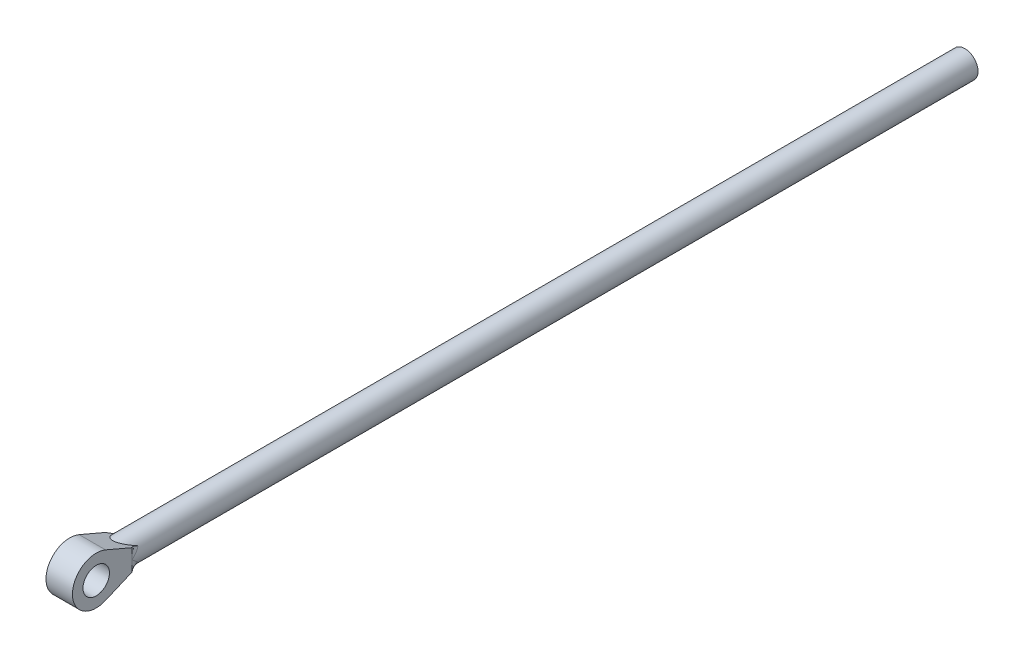
ISO-10303-21;
HEADER;
FILE_DESCRIPTION(('STEP AP214'),'2;1');
FILE_NAME('part.step','',(''),(''),'','','');
FILE_SCHEMA(('AUTOMOTIVE_DESIGN { 1 0 10303 214 1 1 1 1 }'));
ENDSEC;
DATA;
#1=APPLICATION_CONTEXT('core data for automotive mechanical design processes');
#2=APPLICATION_PROTOCOL_DEFINITION('international standard','automotive_design',2000,#1);
#3=PRODUCT_CONTEXT('',#1,'mechanical');
#4=PRODUCT('Part','Part','',(#3));
#5=PRODUCT_RELATED_PRODUCT_CATEGORY('part','',(#4));
#6=PRODUCT_DEFINITION_FORMATION('','',#4);
#7=PRODUCT_DEFINITION_CONTEXT('part definition',#1,'design');
#8=PRODUCT_DEFINITION('design','',#6,#7);
#9=PRODUCT_DEFINITION_SHAPE('','',#8);
#10=(LENGTH_UNIT() NAMED_UNIT(*) SI_UNIT(.MILLI.,.METRE.));
#11=(NAMED_UNIT(*) PLANE_ANGLE_UNIT() SI_UNIT($,.RADIAN.));
#12=(NAMED_UNIT(*) SI_UNIT($,.STERADIAN.) SOLID_ANGLE_UNIT());
#13=UNCERTAINTY_MEASURE_WITH_UNIT(LENGTH_MEASURE(1.E-05),#10,'distance_accuracy_value','');
#14=(GEOMETRIC_REPRESENTATION_CONTEXT(3) GLOBAL_UNCERTAINTY_ASSIGNED_CONTEXT((#13)) GLOBAL_UNIT_ASSIGNED_CONTEXT((#10,
#11,#12)) REPRESENTATION_CONTEXT('',''));
#15=CARTESIAN_POINT('',(0.,0.,0.));
#16=DIRECTION('',(0.,0.,1.));
#17=DIRECTION('',(1.,0.,0.));
#18=AXIS2_PLACEMENT_3D('',#15,#16,#17);
#19=CARTESIAN_POINT('',(3.175,-2.54,-8.59666640241181));
#20=DIRECTION('',(0.,0.919488252420341,0.393117480736976));
#21=DIRECTION('',(0.,-0.393117480736976,0.919488252420342));
#22=AXIS2_PLACEMENT_3D('',#19,#20,#21);
#23=PLANE('',#22);
#24=CARTESIAN_POINT('',(0.,0.,-14.5376389502871));
#25=DIRECTION('',(0.,0.919488252420341,0.393117480736976));
#26=DIRECTION('',(0.,0.393117480736976,-0.919488252420342));
#27=AXIS2_PLACEMENT_3D('',#24,#25,#26);
#28=ELLIPSE('',#27,8.07646608349199,3.175);
#29=CARTESIAN_POINT('',(2.67478021597462,-1.71060685028173,-10.5365884236224));
#30=VERTEX_POINT('',#29);
#31=CARTESIAN_POINT('',(-2.67478021597462,-1.71060685028173,-10.5365884236224));
#32=VERTEX_POINT('',#31);
#33=EDGE_CURVE('E59',#30,#32,#28,.F.);
#34=ORIENTED_EDGE('',*,*,#33,.F.);
#35=CARTESIAN_POINT('',(3.175,-3.99391372425977,-8.59666640241181));
#36=CARTESIAN_POINT('',(1.91635195902802,-2.58180728087389,-9.08135002022511));
#37=CARTESIAN_POINT('',(2.2709843247912,-2.2188409579221,-10.9669928924115));
#38=CARTESIAN_POINT('',(3.175,-3.89822005365016,-8.59666640241181));
#39=CARTESIAN_POINT('',(1.95759279660153,-2.55659693582673,-9.12196996566286));
#40=CARTESIAN_POINT('',(2.32292862845712,-2.16567780741768,-10.930950971675));
#41=CARTESIAN_POINT('',(3.175,-3.80022115930709,-8.59666640241181));
#42=CARTESIAN_POINT('',(2.00429072887889,-2.5244105662156,-9.15651333968208));
#43=CARTESIAN_POINT('',(2.37247234749937,-2.1112339772152,-10.8902967558312));
#44=CARTESIAN_POINT('',(3.175,-3.60055329402831,-8.59666640241181));
#45=CARTESIAN_POINT('',(2.10288828272783,-2.44821078011972,-9.2124927740083));
#46=CARTESIAN_POINT('',(2.46671432485945,-2.0003073854646,-10.8012878913684));
#47=CARTESIAN_POINT('',(3.175,-3.49889095821979,-8.59666640241181));
#48=CARTESIAN_POINT('',(2.15470476601244,-2.40445660023307,-9.23428275530779));
#49=CARTESIAN_POINT('',(2.51142080890993,-1.9438283100981,-10.7529466716865));
#50=CARTESIAN_POINT('',(3.175,-3.29305802574432,-8.59666640241181));
#51=CARTESIAN_POINT('',(2.25918856417076,-2.30694472080806,-9.26551549867763));
#52=CARTESIAN_POINT('',(2.59589449034021,-1.82947668099294,-10.6502315770057));
#53=CARTESIAN_POINT('',(3.175,-3.18890394684718,-8.59666640241181));
#54=CARTESIAN_POINT('',(2.31189565918958,-2.25339342902035,-9.27530338538349));
#55=CARTESIAN_POINT('',(2.63568706696168,-1.77161330379369,-10.5958917037651));
#56=CARTESIAN_POINT('',(3.175,-2.97809879860918,-8.59666640241181));
#57=CARTESIAN_POINT('',(2.415737066997,-2.13788631172421,-9.28426183538017));
#58=CARTESIAN_POINT('',(2.71073717770064,-1.65449933253319,-10.4820493293361));
#59=CARTESIAN_POINT('',(3.175,-2.87144627945739,-8.59666640241181));
#60=CARTESIAN_POINT('',(2.46698878164801,-2.07598791576069,-9.2836366142665));
#61=CARTESIAN_POINT('',(2.74599199749794,-1.59524793302146,-10.4225437735276));
#62=CARTESIAN_POINT('',(3.175,-2.45809990923821,-8.59666640241181));
#63=CARTESIAN_POINT('',(2.65372910886165,-1.82885051358634,-9.26383542983603));
#64=CARTESIAN_POINT('',(2.87287229613947,-1.36561106071748,-10.1860471642477));
#65=CARTESIAN_POINT('',(3.175,-2.14412743110158,-8.59666640241181));
#66=CARTESIAN_POINT('',(2.78145144382993,-1.61490717806444,-9.2138654185811));
#67=CARTESIAN_POINT('',(2.9489698685196,-1.19118190617343,-9.99419431779141));
#68=CARTESIAN_POINT('',(3.175,-1.50745726875889,-8.59666640241181));
#69=CARTESIAN_POINT('',(2.98354146972774,-1.159687990128,-9.07123962113244));
#70=CARTESIAN_POINT('',(3.06825926307117,-0.837476260415707,-9.59223853373834));
#71=CARTESIAN_POINT('',(3.175,-1.18474093473537,-8.59666640241181));
#72=CARTESIAN_POINT('',(3.06100044766743,-0.91555636745583,-8.97863920011173));
#73=CARTESIAN_POINT('',(3.11137388897597,-0.658189408192424,-9.38209405614999));
#74=CARTESIAN_POINT('',(3.175,-0.71952408724998,-8.59666640241181));
#75=CARTESIAN_POINT('',(3.13141138232832,-0.558155895048426,-8.83342360639511));
#76=CARTESIAN_POINT('',(3.15072965960417,-0.39973560402509,-9.0753075460424));
#77=CARTESIAN_POINT('',(3.175,-0.578219683916854,-8.59666640241181));
#78=CARTESIAN_POINT('',(3.14749268943646,-0.448982202265444,-8.78784669658839));
#79=CARTESIAN_POINT('',(3.15969106547785,-0.321233157722816,-8.98161928182636));
#80=CARTESIAN_POINT('',(3.175,-0.295456882461807,-8.59666640241181));
#81=CARTESIAN_POINT('',(3.16908360806762,-0.229956089790282,-8.69520065085295));
#82=CARTESIAN_POINT('',(3.17173138716422,-0.164142712471253,-8.79363104917733));
#83=CARTESIAN_POINT('',(3.175,-0.153999062517953,-8.59666640241181));
#84=CARTESIAN_POINT('',(3.17467408200621,-0.119781543608713,-8.64800082128869));
#85=CARTESIAN_POINT('',(3.17481939932961,-0.0855550347319821,-8.69933225397546));
#86=CARTESIAN_POINT('',(3.175,-0.00838676855715619,-8.59666640241181));
#87=CARTESIAN_POINT('',(3.17499540716319,-0.00652304627986016,-8.59946199393057));
#88=CARTESIAN_POINT('',(3.1749974348638,-0.00465931586509317,-8.60225758054907));
#89=CARTESIAN_POINT('',(3.175,-0.0041933642145215,-8.59666640241181));
#90=CARTESIAN_POINT('',(3.17500002361483,-0.00326150528047754,-8.59806419065323));
#91=CARTESIAN_POINT('',(3.17499999886311,-0.00232964678585178,-8.59946197762139));
#92=CARTESIAN_POINT('',(3.175,0.,-8.59666640241181));
#93=CARTESIAN_POINT('',(3.175,0.,-8.59666640241181));
#94=CARTESIAN_POINT('',(3.175,0.,-8.59666640241181));
#95=(BOUNDED_SURFACE() B_SPLINE_SURFACE(3,2,((#35,#36,#37),(#38,#39,#40),(#41,#42,#43),(#44,#45,
#46),(#47,#48,#49),(#50,#51,#52),(#53,#54,#55),(#56,#57,#58),(#59,#60,#61),(#62,#63,#64),(#65,
#66,#67),(#68,#69,#70),(#71,#72,#73),(#74,#75,#76),(#77,#78,#79),(#80,#81,#82),(#83,#84,#85),
(#86,#87,#88),(#89,#90,#91),(#92,#93,#94)),.UNSPECIFIED.,.F.,.F.,
.F.) B_SPLINE_SURFACE_WITH_KNOTS((4,2,2,2,2,2,2,2,2,4),(3,3),(0.,0.415332256370436,
0.829946755224234,1.24232133703608,1.654941451117,2.82617024859253,4.00013197924569,
4.51081216118512,5.02070078684461,5.03582031698667),(0.,1.),
.UNSPECIFIED.) GEOMETRIC_REPRESENTATION_ITEM() RATIONAL_B_SPLINE_SURFACE(((1.,0.792792193937669,
1.),(1.,0.802959628543372,1.),(1.,0.813010799359625,1.),(1.,0.832659898007525,1.),(1.,
0.842258579094277,1.),(1.,0.860768395540024,1.),(1.,0.869682965154839,1.),(1.,0.886767288107134,
1.),(1.,0.894936594812638,1.),(1.,0.924685397988841,1.),(1.,0.943306333627146,1.),(1.,
0.972868676598953,1.),(1.,0.983792063214889,1.),(1.,0.993800512945255,1.),(1.,0.996087213683453,
1.),(1.,0.999162677962766,1.),(1.,0.99995375781857,1.),(1.,0.999999344324297,1.),(1.,
1.00000000050463,1.),(1.,1.,1.))) REPRESENTATION_ITEM('') SURFACE());
#96=CARTESIAN_POINT('',(2.67478021597462,-1.71060685028173,-10.5365884236224));
#97=CARTESIAN_POINT('',(2.65896090264,-1.73531539556926,-10.4787959869083));
#98=CARTESIAN_POINT('',(2.64593621557644,-1.76029878647662,-10.420360695753));
#99=CARTESIAN_POINT('',(2.62553049389253,-1.81061036745387,-10.3026836400732));
#100=CARTESIAN_POINT('',(2.61814746922412,-1.83593843273112,-10.2434421674344));
#101=CARTESIAN_POINT('',(2.60910197685768,-1.88656334811981,-10.1250322333547));
#102=CARTESIAN_POINT('',(2.60739739857218,-1.91185903103886,-10.0658665019366));
#103=CARTESIAN_POINT('',(2.6095066684818,-1.96240864273729,-9.94763270059563));
#104=CARTESIAN_POINT('',(2.61332064463398,-1.9876625705349,-9.88856463296902));
#105=CARTESIAN_POINT('',(2.63281257740658,-2.06303534503004,-9.71227030850734));
#106=CARTESIAN_POINT('',(2.65652439970803,-2.1128621816823,-9.59572705311423));
#107=CARTESIAN_POINT('',(2.72339626694493,-2.2105517330952,-9.36723455580789));
#108=CARTESIAN_POINT('',(2.76661269268708,-2.25840831180812,-9.25529966589898));
#109=CARTESIAN_POINT('',(2.86511682529915,-2.34680416276593,-9.04854481397524));
#110=CARTESIAN_POINT('',(2.91888766253763,-2.38760837538996,-8.95310516553549));
#111=CARTESIAN_POINT('',(3.03839194604737,-2.466147032211,-8.76940595131474));
#112=CARTESIAN_POINT('',(3.10406499104079,-2.50389564396833,-8.68111324809796));
#113=CARTESIAN_POINT('',(3.175,-2.54,-8.59666640241181));
#114=B_SPLINE_CURVE_WITH_KNOTS('',3,(#96,#97,#98,#99,#100,#101,#102,#103,#104,#105,#106,#107,
#108,#109,#110,#111,#112,#113),.UNSPECIFIED.,.F.,.F.,(4,2,2,2,2,2,2,2,4),(0.,0.194369428069471,
0.388670262298564,0.581526941681752,0.774388092846381,1.15937812629279,1.54548822699539,
1.89529807344013,2.24338003319203),.UNSPECIFIED.);
#115=CARTESIAN_POINT('',(3.175,-2.54,-8.59666640241181));
#116=VERTEX_POINT('',#115);
#117=EDGE_CURVE('E102',#30,#116,#114,.T.);
#118=ORIENTED_EDGE('',*,*,#117,.T.);
#119=DIRECTION('',(0.,0.393117480736976,-0.919488252420341));
#120=VECTOR('',#119,1.);
#121=CARTESIAN_POINT('',(3.175,-2.54,-8.59666640241181));
#122=LINE('',#121,#120);
#123=CARTESIAN_POINT('',(3.175,-5.25487536258225,-2.24666640241182));
#124=VERTEX_POINT('',#123);
#125=EDGE_CURVE('E96',#124,#116,#122,.T.);
#126=ORIENTED_EDGE('',*,*,#125,.F.);
#127=DIRECTION('',(-1.,0.,0.));
#128=VECTOR('',#127,1.);
#129=CARTESIAN_POINT('',(3.175,-5.25487536258225,-2.24666640241182));
#130=LINE('',#129,#128);
#131=CARTESIAN_POINT('',(-3.175,-5.25487536258225,-2.24666640241182));
#132=VERTEX_POINT('',#131);
#133=EDGE_CURVE('E99',#124,#132,#130,.T.);
#134=ORIENTED_EDGE('',*,*,#133,.T.);
#135=DIRECTION('',(0.,0.393117480736976,-0.919488252420341));
#136=VECTOR('',#135,1.);
#137=CARTESIAN_POINT('',(-3.175,-2.54,-8.59666640241181));
#138=LINE('',#137,#136);
#139=CARTESIAN_POINT('',(-3.175,-2.54,-8.59666640241181));
#140=VERTEX_POINT('',#139);
#141=EDGE_CURVE('E263',#132,#140,#138,.T.);
#142=ORIENTED_EDGE('',*,*,#141,.T.);
#143=CARTESIAN_POINT('',(-2.27098432479365,-2.21884095791959,-10.9669928924098));
#144=CARTESIAN_POINT('',(-1.91635195902998,-2.58180728087268,-9.08135002022703));
#145=CARTESIAN_POINT('',(-3.175,-3.99391372425527,-8.59666640241181));
#146=CARTESIAN_POINT('',(-2.32292862845958,-2.16567780741504,-10.9309509716731));
#147=CARTESIAN_POINT('',(-1.95759279660373,-2.55659693582527,-9.12196996566466));
#148=CARTESIAN_POINT('',(-3.175,-3.89822005364541,-8.59666640241181));
#149=CARTESIAN_POINT('',(-2.37247234750184,-2.11123397721242,-10.8902967558291));
#150=CARTESIAN_POINT('',(-2.0042907288813,-2.52441056621388,-9.15651333968373));
#151=CARTESIAN_POINT('',(-3.175,-3.8002211593021,-8.59666640241181));
#152=CARTESIAN_POINT('',(-2.46671432486192,-2.00030738546156,-10.8012878913658));
#153=CARTESIAN_POINT('',(-2.10288828273059,-2.44821078011745,-9.2124927740096));
#154=CARTESIAN_POINT('',(-3.175,-3.60055329402282,-8.59666640241181));
#155=CARTESIAN_POINT('',(-2.5114208089124,-1.94382831009492,-10.7529466716838));
#156=CARTESIAN_POINT('',(-2.15470476601536,-2.40445660023053,-9.2342827553089));
#157=CARTESIAN_POINT('',(-3.175,-3.49889095821406,-8.59666640241181));
#158=CARTESIAN_POINT('',(-2.59589449034265,-1.82947668098949,-10.6502315770025));
#159=CARTESIAN_POINT('',(-2.25918856417391,-2.30694472080496,-9.26551549867833));
#160=CARTESIAN_POINT('',(-3.175,-3.29305802573812,-8.59666640241181));
#161=CARTESIAN_POINT('',(-2.63568706696408,-1.77161330379011,-10.5958917037617));
#162=CARTESIAN_POINT('',(-2.31189565919281,-2.25339342901697,-9.27530338538399));
#163=CARTESIAN_POINT('',(-3.175,-3.18890394684074,-8.59666640241181));
#164=CARTESIAN_POINT('',(-2.71073717770298,-1.65449933252936,-10.4820493293323));
#165=CARTESIAN_POINT('',(-2.41573706700034,-2.13788631172029,-9.28426183538024));
#166=CARTESIAN_POINT('',(-3.175,-2.97809879860228,-8.59666640241181));
#167=CARTESIAN_POINT('',(-2.74599199750024,-1.5952479330175,-10.4225437735236));
#168=CARTESIAN_POINT('',(-2.46698878165138,-2.07598791575649,-9.28363661426636));
#169=CARTESIAN_POINT('',(-3.175,-2.87144627945026,-8.59666640241181));
#170=CARTESIAN_POINT('',(-2.87287229614157,-1.36561106071309,-10.1860471642429));
#171=CARTESIAN_POINT('',(-2.65372910886501,-1.82885051358119,-9.26383542983508));
#172=CARTESIAN_POINT('',(-3.175,-2.45809990923031,-8.59666640241181));
#173=CARTESIAN_POINT('',(-2.94896986852151,-1.19118190616876,-9.99419431778613));
#174=CARTESIAN_POINT('',(-2.7814514438331,-1.61490717805865,-9.21386541857955));
#175=CARTESIAN_POINT('',(-3.175,-2.14412743109317,-8.59666640241181));
#176=CARTESIAN_POINT('',(-3.06825926307263,-0.837476260410397,-9.59223853373227));
#177=CARTESIAN_POINT('',(-2.98354146973029,-1.15968799012094,-9.07123962112996));
#178=CARTESIAN_POINT('',(-3.175,-1.50745726874933,-8.59666640241181));
#179=CARTESIAN_POINT('',(-3.11137388897716,-0.658189408186761,-9.38209405614367));
#180=CARTESIAN_POINT('',(-3.06100044766955,-0.915556367448113,-8.97863920010891));
#181=CARTESIAN_POINT('',(-3.175,-1.18474093472518,-8.59666640241181));
#182=CARTESIAN_POINT('',(-3.15072965960476,-0.399735604020243,-9.07530754603647));
#183=CARTESIAN_POINT('',(-3.13141138232938,-0.558155895041695,-8.83342360639224));
#184=CARTESIAN_POINT('',(-3.175,-0.719524087241256,-8.59666640241181));
#185=CARTESIAN_POINT('',(-3.15969106547823,-0.32123315771901,-8.9816192818214));
#186=CARTESIAN_POINT('',(-3.14749268943713,-0.448982202260144,-8.78784669658596));
#187=CARTESIAN_POINT('',(-3.175,-0.578219683910004,-8.59666640241181));
#188=CARTESIAN_POINT('',(-3.17173138716429,-0.164142712469191,-8.79363104917527));
#189=CARTESIAN_POINT('',(-3.16908360806776,-0.229956089787388,-8.69520065085192));
#190=CARTESIAN_POINT('',(-3.175,-0.295456882458093,-8.59666640241181));
#191=CARTESIAN_POINT('',(-3.17481939932961,-0.0855550347306216,-8.69933225397532));
#192=CARTESIAN_POINT('',(-3.17467408200621,-0.119781543606808,-8.64800082128861));
#193=CARTESIAN_POINT('',(-3.175,-0.153999062515503,-8.59666640241181));
#194=CARTESIAN_POINT('',(-3.1749974348638,-0.00465931586507049,-8.60225758054913));
#195=CARTESIAN_POINT('',(-3.17499540716319,-0.00652304627982837,-8.59946199393061));
#196=CARTESIAN_POINT('',(-3.175,-0.00838676855711528,-8.59666640241181));
#197=CARTESIAN_POINT('',(-3.17499999886311,-0.00232964678584015,-8.59946197762142));
#198=CARTESIAN_POINT('',(-3.17500002361483,-0.00326150528046124,-8.59806419065324));
#199=CARTESIAN_POINT('',(-3.175,-0.00419336421450054,-8.59666640241181));
#200=CARTESIAN_POINT('',(-3.175,0.,-8.59666640241181));
#201=CARTESIAN_POINT('',(-3.175,0.,-8.59666640241181));
#202=CARTESIAN_POINT('',(-3.175,0.,-8.59666640241181));
#203=(BOUNDED_SURFACE() B_SPLINE_SURFACE(3,2,((#143,#144,#145),(#146,#147,#148),(#149,#150,
#151),(#152,#153,#154),(#155,#156,#157),(#158,#159,#160),(#161,#162,#163),(#164,#165,#166),
(#167,#168,#169),(#170,#171,#172),(#173,#174,#175),(#176,#177,#178),(#179,#180,#181),(#182,#183,
#184),(#185,#186,#187),(#188,#189,#190),(#191,#192,#193),(#194,#195,#196),(#197,#198,#199),
(#200,#201,#202)),.UNSPECIFIED.,.F.,.F.,.F.) B_SPLINE_SURFACE_WITH_KNOTS((4,2,2,2,2,2,2,2,2,4),
(3,3),(0.,0.415332256371179,0.82994675522572,1.24232133703825,1.65494145111987,2.82617024859706,
4.00013197925189,4.51081216118494,5.02070078683809,5.03582031698015),(0.,1.),
.UNSPECIFIED.) GEOMETRIC_REPRESENTATION_ITEM() RATIONAL_B_SPLINE_SURFACE(((1.,0.792792193938146,
1.),(1.,0.802959628543865,1.),(1.,0.813010799360131,1.),(1.,0.832659898008051,1.),(1.,
0.842258579094809,1.),(1.,0.860768395540565,1.),(1.,0.869682965155381,1.),(1.,0.886767288107673,
1.),(1.,0.894936594813173,1.),(1.,0.924685397989347,1.),(1.,0.943306333627614,1.),(1.,
0.972868676599319,1.),(1.,0.983792063215191,1.),(1.,0.993800512945407,1.),(1.,0.996087213683549,
1.),(1.,0.999162677962785,1.),(1.,0.999953757818569,1.),(1.,0.999999344324297,1.),(1.,
1.00000000050463,1.),(1.,1.,1.))) REPRESENTATION_ITEM('') SURFACE());
#204=CARTESIAN_POINT('',(-3.175,-2.54,-8.59666640241181));
#205=CARTESIAN_POINT('',(-3.12274790795525,-2.51339513186286,-8.65889427297974));
#206=CARTESIAN_POINT('',(-3.07338709167486,-2.48593299171681,-8.72312727326067));
#207=CARTESIAN_POINT('',(-2.98094895119323,-2.42936341368688,-8.85544156858376));
#208=CARTESIAN_POINT('',(-2.93788130463324,-2.40025353531847,-8.92352857183519));
#209=CARTESIAN_POINT('',(-2.81881369723286,-2.31046730182375,-9.13353548064192));
#210=CARTESIAN_POINT('',(-2.75333444689144,-2.24752780330389,-9.28074880067477));
#211=CARTESIAN_POINT('',(-2.66826345745968,-2.13346753368451,-9.54753184422273));
#212=CARTESIAN_POINT('',(-2.64139521950859,-2.08318111873803,-9.66515003742274));
#213=CARTESIAN_POINT('',(-2.617475663847,-2.00708677037642,-9.84313209831434));
#214=CARTESIAN_POINT('',(-2.61222784708377,-1.98165670452371,-9.90261214678741));
#215=CARTESIAN_POINT('',(-2.60731207132854,-1.93071606147583,-10.0217605569915));
#216=CARTESIAN_POINT('',(-2.60764249931384,-1.90520550968744,-10.081428859297));
#217=CARTESIAN_POINT('',(-2.614369663958,-1.85126915700596,-10.207584131192));
#218=CARTESIAN_POINT('',(-2.62148185356562,-1.82285677160672,-10.2740397224032));
#219=CARTESIAN_POINT('',(-2.6428027895673,-1.76638189740917,-10.406132508723));
#220=CARTESIAN_POINT('',(-2.6570273705171,-1.7383203331824,-10.4717675412905));
#221=CARTESIAN_POINT('',(-2.67478021597498,-1.71060685028117,-10.5365884236221));
#222=B_SPLINE_CURVE_WITH_KNOTS('',3,(#204,#205,#206,#207,#208,#209,#210,#211,#212,#213,#214,
#215,#216,#217,#218,#219,#220,#221),.UNSPECIFIED.,.F.,.F.,(4,2,2,2,2,2,2,2,4),(0.,
0.256328898497091,0.513047922516331,1.02833474887131,1.41868761538263,1.61317812630623,
1.80761239870895,2.0251272446223,2.24312852188396),.UNSPECIFIED.);
#223=EDGE_CURVE('E44',#140,#32,#222,.T.);
#224=ORIENTED_EDGE('',*,*,#223,.T.);
#225=EDGE_LOOP('',(#34,#118,#126,#134,#142,#224));
#226=FACE_BOUND('',#225,.T.);
#227=ADVANCED_FACE('F32',(#226),#23,.F.);
#228=CARTESIAN_POINT('',(3.175,5.25487536258225,-2.24666640241182));
#229=DIRECTION('',(0.,-0.919488252420341,0.393117480736976));
#230=DIRECTION('',(0.,-0.393117480736976,-0.919488252420342));
#231=AXIS2_PLACEMENT_3D('',#228,#229,#230);
#232=PLANE('',#231);
#233=CARTESIAN_POINT('',(0.,0.,-14.5376389502871));
#234=DIRECTION('',(0.,-0.919488252420341,0.393117480736976));
#235=DIRECTION('',(0.,-0.393117480736976,-0.919488252420342));
#236=AXIS2_PLACEMENT_3D('',#233,#234,#235);
#237=ELLIPSE('',#236,8.07646608349199,3.175);
#238=CARTESIAN_POINT('',(-2.67478021597462,1.71060685028173,-10.5365884236224));
#239=VERTEX_POINT('',#238);
#240=CARTESIAN_POINT('',(2.67478021597462,1.71060685028173,-10.5365884236224));
#241=VERTEX_POINT('',#240);
#242=EDGE_CURVE('E51',#239,#241,#237,.F.);
#243=ORIENTED_EDGE('',*,*,#242,.F.);
#244=CARTESIAN_POINT('',(-3.175,3.99391372425977,-8.59666640241181));
#245=CARTESIAN_POINT('',(-1.91635195902802,2.58180728087388,-9.08135002022511));
#246=CARTESIAN_POINT('',(-2.27098432479121,2.21884095792209,-10.9669928924115));
#247=CARTESIAN_POINT('',(-3.175,3.89822005365014,-8.59666640241181));
#248=CARTESIAN_POINT('',(-1.95759279660154,2.55659693582672,-9.12196996566286));
#249=CARTESIAN_POINT('',(-2.32292862845713,2.16567780741767,-10.930950971675));
#250=CARTESIAN_POINT('',(-3.175,3.80022115930706,-8.59666640241181));
#251=CARTESIAN_POINT('',(-2.00429072887891,2.52441056621559,-9.15651333968209));
#252=CARTESIAN_POINT('',(-2.37247234749938,2.11123397721518,-10.8902967558312));
#253=CARTESIAN_POINT('',(-3.175,3.60055329402824,-8.59666640241181));
#254=CARTESIAN_POINT('',(-2.10288828272786,2.44821078011969,-9.21249277400832));
#255=CARTESIAN_POINT('',(-2.46671432485948,2.00030738546457,-10.8012878913684));
#256=CARTESIAN_POINT('',(-3.175,3.49889095821971,-8.59666640241181));
#257=CARTESIAN_POINT('',(-2.15470476601248,2.40445660023304,-9.23428275530781));
#258=CARTESIAN_POINT('',(-2.51142080890997,1.94382831009806,-10.7529466716865));
#259=CARTESIAN_POINT('',(-3.175,3.29305802574424,-8.59666640241181));
#260=CARTESIAN_POINT('',(-2.2591885641708,2.30694472080802,-9.26551549867764));
#261=CARTESIAN_POINT('',(-2.59589449034024,1.8294766809929,-10.6502315770056));
#262=CARTESIAN_POINT('',(-3.175,3.18890394684711,-8.59666640241181));
#263=CARTESIAN_POINT('',(-2.31189565918962,2.25339342902031,-9.2753033853835));
#264=CARTESIAN_POINT('',(-2.6356870669617,1.77161330379365,-10.595891703765));
#265=CARTESIAN_POINT('',(-3.175,2.97809879860914,-8.59666640241181));
#266=CARTESIAN_POINT('',(-2.41573706699702,2.13788631172419,-9.28426183538017));
#267=CARTESIAN_POINT('',(-2.71073717770065,1.65449933253317,-10.482049329336));
#268=CARTESIAN_POINT('',(-3.175,2.87144627945736,-8.59666640241181));
#269=CARTESIAN_POINT('',(-2.46698878164802,2.07598791576067,-9.2836366142665));
#270=CARTESIAN_POINT('',(-2.74599199749794,1.59524793302144,-10.4225437735276));
#271=CARTESIAN_POINT('',(-3.175,2.45809990923822,-8.59666640241181));
#272=CARTESIAN_POINT('',(-2.65372910886164,1.82885051358635,-9.26383542983602));
#273=CARTESIAN_POINT('',(-2.87287229613947,1.36561106071749,-10.1860471642477));
#274=CARTESIAN_POINT('',(-3.175,2.14412743110167,-8.59666640241181));
#275=CARTESIAN_POINT('',(-2.78145144382993,1.61490717806451,-9.21386541858104));
#276=CARTESIAN_POINT('',(-2.9489698685196,1.19118190617348,-9.99419431779131));
#277=CARTESIAN_POINT('',(-3.175,1.50745726875883,-8.59666640241181));
#278=CARTESIAN_POINT('',(-2.98354146972773,1.15968799012795,-9.0712396211325));
#279=CARTESIAN_POINT('',(-3.06825926307117,0.837476260415675,-9.59223853373845));
#280=CARTESIAN_POINT('',(-3.175,1.18474093473509,-8.59666640241181));
#281=CARTESIAN_POINT('',(-3.06100044766743,0.915556367455609,-8.97863920011195));
#282=CARTESIAN_POINT('',(-3.11137388897597,0.658189408192269,-9.38209405615041));
#283=CARTESIAN_POINT('',(-3.175,0.719524087250087,-8.59666640241181));
#284=CARTESIAN_POINT('',(-3.13141138232832,0.55815589504851,-8.83342360639501));
#285=CARTESIAN_POINT('',(-3.15072965960417,0.399735604025149,-9.07530754604221));
#286=CARTESIAN_POINT('',(-3.175,0.578219683917175,-8.59666640241181));
#287=CARTESIAN_POINT('',(-3.14749268943646,0.448982202265695,-8.78784669658813));
#288=CARTESIAN_POINT('',(-3.15969106547785,0.321233157722994,-8.98161928182585));
#289=CARTESIAN_POINT('',(-3.175,0.295456882461466,-8.59666640241181));
#290=CARTESIAN_POINT('',(-3.16908360806762,0.229956089790016,-8.6952006508532));
#291=CARTESIAN_POINT('',(-3.17173138716422,0.164142712471064,-8.79363104917782));
#292=CARTESIAN_POINT('',(-3.175,0.153999062516737,-8.59666640241181));
#293=CARTESIAN_POINT('',(-3.17467408200621,0.119781543607768,-8.6480008212896));
#294=CARTESIAN_POINT('',(-3.17481939932961,0.0855550347313069,-8.69933225397727));
#295=CARTESIAN_POINT('',(-3.175,0.0083867685570856,-8.59666640241181));
#296=CARTESIAN_POINT('',(-3.17499540716319,0.00652304627980527,-8.59946199393063));
#297=CARTESIAN_POINT('',(-3.1749974348638,0.00465931586505396,-8.60225758054918));
#298=CARTESIAN_POINT('',(-3.175,0.0041933642144853,-8.59666640241181));
#299=CARTESIAN_POINT('',(-3.17500002361483,0.00326150528044939,-8.59806419065325));
#300=CARTESIAN_POINT('',(-3.17499999886311,0.00232964678583167,-8.59946197762145));
#301=CARTESIAN_POINT('',(-3.175,0.,-8.59666640241181));
#302=CARTESIAN_POINT('',(-3.175,0.,-8.59666640241181));
#303=CARTESIAN_POINT('',(-3.175,0.,-8.59666640241181));
#304=(BOUNDED_SURFACE() B_SPLINE_SURFACE(3,2,((#244,#245,#246),(#247,#248,#249),(#250,#251,
#252),(#253,#254,#255),(#256,#257,#258),(#259,#260,#261),(#262,#263,#264),(#265,#266,#267),
(#268,#269,#270),(#271,#272,#273),(#274,#275,#276),(#277,#278,#279),(#280,#281,#282),(#283,#284,
#285),(#286,#287,#288),(#289,#290,#291),(#292,#293,#294),(#295,#296,#297),(#298,#299,#300),
(#301,#302,#303)),.UNSPECIFIED.,.F.,.F.,.F.) B_SPLINE_SURFACE_WITH_KNOTS((4,2,2,2,2,2,2,2,2,4),
(3,3),(0.,0.415332256370493,0.829946755224349,1.24232133703614,1.65494145111701,
2.82617024859249,4.0001319792457,4.51081216118512,5.0207007868446,5.03582031698666),(0.,1.),
.UNSPECIFIED.) GEOMETRIC_REPRESENTATION_ITEM() RATIONAL_B_SPLINE_SURFACE(((1.,0.792792193937669,
1.),(1.,0.802959628543374,1.),(1.,0.813010799359628,1.),(1.,0.832659898007531,1.),(1.,
0.842258579094283,1.),(1.,0.860768395540031,1.),(1.,0.869682965154845,1.),(1.,0.886767288107137,
1.),(1.,0.89493659481264,1.),(1.,0.92468539798884,1.),(1.,0.943306333627145,1.),(1.,
0.972868676598952,1.),(1.,0.983792063214889,1.),(1.,0.993800512945255,1.),(1.,0.996087213683454,
1.),(1.,0.999162677962766,1.),(1.,0.999953757818569,1.),(1.,0.999999344324297,1.),(1.,
1.00000000050463,1.),(1.,1.,1.))) REPRESENTATION_ITEM('') SURFACE());
#305=CARTESIAN_POINT('',(-2.67478021597462,1.71060685028173,-10.5365884236224));
#306=CARTESIAN_POINT('',(-2.65896090263902,1.73531539556922,-10.4787959869084));
#307=CARTESIAN_POINT('',(-2.64593621557562,1.76029878647659,-10.4203606957531));
#308=CARTESIAN_POINT('',(-2.62553049389237,1.81061036745386,-10.3026836400732));
#309=CARTESIAN_POINT('',(-2.61814746922445,1.83593843273113,-10.2434421674343));
#310=CARTESIAN_POINT('',(-2.60910197685734,1.88656334811987,-10.1250322333545));
#311=CARTESIAN_POINT('',(-2.6073973985707,1.91185903103896,-10.0658665019364));
#312=CARTESIAN_POINT('',(-2.60950666848023,1.96240864273737,-9.94763270059544));
#313=CARTESIAN_POINT('',(-2.61332064463344,1.98766257053494,-9.88856463296893));
#314=CARTESIAN_POINT('',(-2.6328125774076,2.06303534502972,-9.71227030850808));
#315=CARTESIAN_POINT('',(-2.65652439970804,2.1128621816817,-9.59572705311563));
#316=CARTESIAN_POINT('',(-2.72339626694412,2.21055173309463,-9.36723455580921));
#317=CARTESIAN_POINT('',(-2.76661269268669,2.25840831180784,-9.25529966589963));
#318=CARTESIAN_POINT('',(-2.865116825298,2.34680416276482,-9.04854481397783));
#319=CARTESIAN_POINT('',(-2.91888766253483,2.38760837538781,-8.95310516554052));
#320=CARTESIAN_POINT('',(-3.03839194604386,2.466147032209,-8.76940595131943));
#321=CARTESIAN_POINT('',(-3.10406499103883,2.50389564396737,-8.68111324810021));
#322=CARTESIAN_POINT('',(-3.175,2.54,-8.59666640241181));
#323=B_SPLINE_CURVE_WITH_KNOTS('',3,(#305,#306,#307,#308,#309,#310,#311,#312,#313,#314,#315,
#316,#317,#318,#319,#320,#321,#322),.UNSPECIFIED.,.F.,.F.,(4,2,2,2,2,2,2,2,4),(0.,
0.194369428069507,0.388670262298641,0.581526941682158,0.774388092846556,1.15937812629067,
1.54548822699557,1.8952980734311,2.2433800331922),.UNSPECIFIED.);
#324=CARTESIAN_POINT('',(-3.175,2.54,-8.59666640241181));
#325=VERTEX_POINT('',#324);
#326=EDGE_CURVE('E187',#239,#325,#323,.T.);
#327=ORIENTED_EDGE('',*,*,#326,.T.);
#328=DIRECTION('',(0.,0.393117480736976,0.919488252420341));
#329=VECTOR('',#328,1.);
#330=CARTESIAN_POINT('',(-3.175,5.25487536258225,-2.24666640241182));
#331=LINE('',#330,#329);
#332=CARTESIAN_POINT('',(-3.175,5.25487536258225,-2.24666640241182));
#333=VERTEX_POINT('',#332);
#334=EDGE_CURVE('E117',#325,#333,#331,.T.);
#335=ORIENTED_EDGE('',*,*,#334,.T.);
#336=DIRECTION('',(-1.,0.,0.));
#337=VECTOR('',#336,1.);
#338=CARTESIAN_POINT('',(3.175,5.25487536258225,-2.24666640241182));
#339=LINE('',#338,#337);
#340=CARTESIAN_POINT('',(3.175,5.25487536258225,-2.24666640241182));
#341=VERTEX_POINT('',#340);
#342=EDGE_CURVE('E123',#341,#333,#339,.T.);
#343=ORIENTED_EDGE('',*,*,#342,.F.);
#344=DIRECTION('',(0.,0.393117480736976,0.919488252420341));
#345=VECTOR('',#344,1.);
#346=CARTESIAN_POINT('',(3.175,5.25487536258225,-2.24666640241182));
#347=LINE('',#346,#345);
#348=CARTESIAN_POINT('',(3.175,2.54,-8.59666640241181));
#349=VERTEX_POINT('',#348);
#350=EDGE_CURVE('E113',#349,#341,#347,.T.);
#351=ORIENTED_EDGE('',*,*,#350,.F.);
#352=CARTESIAN_POINT('',(2.27098432479365,2.2188409579196,-10.9669928924098));
#353=CARTESIAN_POINT('',(1.91635195902998,2.58180728087268,-9.08135002022703));
#354=CARTESIAN_POINT('',(3.175,3.99391372425527,-8.59666640241181));
#355=CARTESIAN_POINT('',(2.32292862845958,2.16567780741504,-10.9309509716731));
#356=CARTESIAN_POINT('',(1.95759279660372,2.55659693582527,-9.12196996566466));
#357=CARTESIAN_POINT('',(3.175,3.89822005364541,-8.59666640241181));
#358=CARTESIAN_POINT('',(2.37247234750183,2.11123397721243,-10.8902967558291));
#359=CARTESIAN_POINT('',(2.0042907288813,2.52441056621388,-9.15651333968372));
#360=CARTESIAN_POINT('',(3.175,3.8002211593021,-8.59666640241181));
#361=CARTESIAN_POINT('',(2.46671432486192,2.00030738546157,-10.8012878913658));
#362=CARTESIAN_POINT('',(2.10288828273059,2.44821078011746,-9.2124927740096));
#363=CARTESIAN_POINT('',(3.175,3.60055329402284,-8.59666640241181));
#364=CARTESIAN_POINT('',(2.51142080891239,1.94382831009493,-10.7529466716838));
#365=CARTESIAN_POINT('',(2.15470476601534,2.40445660023054,-9.2342827553089));
#366=CARTESIAN_POINT('',(3.175,3.49889095821408,-8.59666640241181));
#367=CARTESIAN_POINT('',(2.59589449034264,1.8294766809895,-10.6502315770025));
#368=CARTESIAN_POINT('',(2.25918856417389,2.30694472080497,-9.26551549867833));
#369=CARTESIAN_POINT('',(3.175,3.29305802573814,-8.59666640241181));
#370=CARTESIAN_POINT('',(2.63568706696408,1.77161330379012,-10.5958917037617));
#371=CARTESIAN_POINT('',(2.3118956591928,2.25339342901698,-9.27530338538399));
#372=CARTESIAN_POINT('',(3.175,3.18890394684076,-8.59666640241181));
#373=CARTESIAN_POINT('',(2.71073717770297,1.65449933252937,-10.4820493293323));
#374=CARTESIAN_POINT('',(2.41573706700034,2.1378863117203,-9.28426183538024));
#375=CARTESIAN_POINT('',(3.175,2.97809879860229,-8.59666640241181));
#376=CARTESIAN_POINT('',(2.74599199750023,1.5952479330175,-10.4225437735236));
#377=CARTESIAN_POINT('',(2.46698878165138,2.0759879157565,-9.28363661426636));
#378=CARTESIAN_POINT('',(3.175,2.87144627945027,-8.59666640241181));
#379=CARTESIAN_POINT('',(2.87287229614158,1.36561106071309,-10.186047164243));
#380=CARTESIAN_POINT('',(2.65372910886501,1.82885051358119,-9.26383542983509));
#381=CARTESIAN_POINT('',(3.175,2.4580999092303,-8.59666640241181));
#382=CARTESIAN_POINT('',(2.94896986852152,1.19118190616874,-9.99419431778617));
#383=CARTESIAN_POINT('',(2.7814514438331,1.61490717805862,-9.21386541857957));
#384=CARTESIAN_POINT('',(3.175,2.14412743109314,-8.59666640241181));
#385=CARTESIAN_POINT('',(3.06825926307263,0.837476260410408,-9.59223853373222));
#386=CARTESIAN_POINT('',(2.98354146973029,1.15968799012095,-9.07123962112994));
#387=CARTESIAN_POINT('',(3.175,1.50745726874935,-8.59666640241181));
#388=CARTESIAN_POINT('',(3.11137388897716,0.658189408186815,-9.38209405614352));
#389=CARTESIAN_POINT('',(3.06100044766955,0.91555636744819,-8.97863920010883));
#390=CARTESIAN_POINT('',(3.175,1.18474093472527,-8.59666640241181));
#391=CARTESIAN_POINT('',(3.15072965960476,0.39973560402022,-9.07530754603654));
#392=CARTESIAN_POINT('',(3.13141138232938,0.558155895041663,-8.83342360639227));
#393=CARTESIAN_POINT('',(3.175,0.719524087241215,-8.59666640241181));
#394=CARTESIAN_POINT('',(3.15969106547823,0.321233157718945,-8.98161928182158));
#395=CARTESIAN_POINT('',(3.14749268943713,0.448982202260053,-8.78784669658604));
#396=CARTESIAN_POINT('',(3.175,0.578219683909888,-8.59666640241181));
#397=CARTESIAN_POINT('',(3.17173138716429,0.164142712469257,-8.79363104917508));
#398=CARTESIAN_POINT('',(3.16908360806776,0.22995608978748,-8.69520065085183));
#399=CARTESIAN_POINT('',(3.175,0.295456882458213,-8.59666640241181));
#400=CARTESIAN_POINT('',(3.1748193993296,0.0855550347308609,-8.69933225397466));
#401=CARTESIAN_POINT('',(3.17467408200622,0.119781543607143,-8.6480008212883));
#402=CARTESIAN_POINT('',(3.175,0.153999062515934,-8.59666640241181));
#403=CARTESIAN_POINT('',(3.1749974348638,0.00465931586508478,-8.60225758054909));
#404=CARTESIAN_POINT('',(3.17499540716319,0.00652304627984841,-8.59946199393059));
#405=CARTESIAN_POINT('',(3.175,0.00838676855714107,-8.59666640241181));
#406=CARTESIAN_POINT('',(3.17499999886311,0.00232964678584748,-8.5994619776214));
#407=CARTESIAN_POINT('',(3.17500002361483,0.00326150528047151,-8.59806419065323));
#408=CARTESIAN_POINT('',(3.175,0.00419336421451375,-8.59666640241181));
#409=CARTESIAN_POINT('',(3.175,0.,-8.59666640241181));
#410=CARTESIAN_POINT('',(3.175,0.,-8.59666640241181));
#411=CARTESIAN_POINT('',(3.175,0.,-8.59666640241181));
#412=(BOUNDED_SURFACE() B_SPLINE_SURFACE(3,2,((#352,#353,#354),(#355,#356,#357),(#358,#359,
#360),(#361,#362,#363),(#364,#365,#366),(#367,#368,#369),(#370,#371,#372),(#373,#374,#375),
(#376,#377,#378),(#379,#380,#381),(#382,#383,#384),(#385,#386,#387),(#388,#389,#390),(#391,#392,
#393),(#394,#395,#396),(#397,#398,#399),(#400,#401,#402),(#403,#404,#405),(#406,#407,#408),
(#409,#410,#411)),.UNSPECIFIED.,.F.,.F.,.F.) B_SPLINE_SURFACE_WITH_KNOTS((4,2,2,2,2,2,2,2,2,4),
(3,3),(0.,0.415332256371163,0.829946755225685,1.24232133703823,1.65494145111987,
2.82617024859707,4.00013197925189,4.51081216118495,5.02070078683809,5.03582031698015),(0.,1.),
.UNSPECIFIED.) GEOMETRIC_REPRESENTATION_ITEM() RATIONAL_B_SPLINE_SURFACE(((1.,0.792792193938146,
1.),(1.,0.802959628543865,1.),(1.,0.81301079936013,1.),(1.,0.83265989800805,1.),(1.,
0.842258579094807,1.),(1.,0.860768395540563,1.),(1.,0.869682965155379,1.),(1.,0.886767288107672,
1.),(1.,0.894936594813172,1.),(1.,0.924685397989347,1.),(1.,0.943306333627615,1.),(1.,
0.972868676599319,1.),(1.,0.983792063215191,1.),(1.,0.993800512945407,1.),(1.,0.996087213683549,
1.),(1.,0.999162677962785,1.),(1.,0.999953757818569,1.),(1.,0.999999344324297,1.),(1.,
1.00000000050463,1.),(1.,1.,1.))) REPRESENTATION_ITEM('') SURFACE());
#413=CARTESIAN_POINT('',(3.175,2.54,-8.59666640241181));
#414=CARTESIAN_POINT('',(3.12274790795372,2.51339513186197,-8.65889427298182));
#415=CARTESIAN_POINT('',(3.07338709167186,2.485932991715,-8.7231272732649));
#416=CARTESIAN_POINT('',(2.98094895118771,2.42936341368321,-8.85544156859232));
#417=CARTESIAN_POINT('',(2.93788130462665,2.40025353531387,-8.92352857184596));
#418=CARTESIAN_POINT('',(2.81881369722867,2.31046730181986,-9.13353548065102));
#419=CARTESIAN_POINT('',(2.75333444688975,2.24752780330189,-9.28074880067945));
#420=CARTESIAN_POINT('',(2.66826345745922,2.1334675336837,-9.54753184422464));
#421=CARTESIAN_POINT('',(2.64139521950814,2.08318111873636,-9.66515003742667));
#422=CARTESIAN_POINT('',(2.6174756638463,2.00708677037433,-9.84313209831924));
#423=CARTESIAN_POINT('',(2.6122278470829,1.98165670452206,-9.90261214679127));
#424=CARTESIAN_POINT('',(2.60731207132795,1.93071606147502,-10.0217605569934));
#425=CARTESIAN_POINT('',(2.60764249931371,1.90520550968704,-10.081428859298));
#426=CARTESIAN_POINT('',(2.6143696639582,1.85126915700595,-10.207584131192));
#427=CARTESIAN_POINT('',(2.62148185356573,1.8228567716067,-10.2740397224032));
#428=CARTESIAN_POINT('',(2.64280278956721,1.76638189740915,-10.406132508723));
#429=CARTESIAN_POINT('',(2.65702737051691,1.73832033318239,-10.4717675412906));
#430=CARTESIAN_POINT('',(2.67478021597498,1.71060685028117,-10.5365884236221));
#431=B_SPLINE_CURVE_WITH_KNOTS('',3,(#413,#414,#415,#416,#417,#418,#419,#420,#421,#422,#423,
#424,#425,#426,#427,#428,#429,#430),.UNSPECIFIED.,.F.,.F.,(4,2,2,2,2,2,2,2,4),(0.,
0.2563288985053,0.513047922532326,1.02833474887135,1.41868761538912,1.61317812630939,
1.80761239870903,2.02512724462247,2.24312852188404),.UNSPECIFIED.);
#432=EDGE_CURVE('E11',#349,#241,#431,.T.);
#433=ORIENTED_EDGE('',*,*,#432,.T.);
#434=EDGE_LOOP('',(#243,#327,#335,#343,#351,#433));
#435=FACE_BOUND('',#434,.T.);
#436=ADVANCED_FACE('F178',(#435),#232,.F.);
#437=CARTESIAN_POINT('',(3.175,0.,0.));
#438=DIRECTION('',(1.,0.,0.));
#439=DIRECTION('',(0.,0.,-1.));
#440=AXIS2_PLACEMENT_3D('',#437,#438,#439);
#441=PLANE('',#440);
#442=CARTESIAN_POINT('',(3.175,0.,0.));
#443=DIRECTION('',(1.,0.,0.));
#444=DIRECTION('',(0.,0.,-1.));
#445=AXIS2_PLACEMENT_3D('',#442,#443,#444);
#446=CIRCLE('',#445,5.715);
#447=EDGE_CURVE('E107',#341,#124,#446,.T.);
#448=ORIENTED_EDGE('',*,*,#447,.T.);
#449=ORIENTED_EDGE('',*,*,#125,.T.);
#450=DIRECTION('',(0.,1.,0.));
#451=VECTOR('',#450,1.);
#452=CARTESIAN_POINT('',(3.175,2.54,-8.59666640241181));
#453=LINE('',#452,#451);
#454=CARTESIAN_POINT('',(3.175,0.,-8.5966664024118));
#455=VERTEX_POINT('',#454);
#456=EDGE_CURVE('E261',#116,#455,#453,.T.);
#457=ORIENTED_EDGE('',*,*,#456,.T.);
#458=EDGE_CURVE('E106',#455,#349,#453,.T.);
#459=ORIENTED_EDGE('',*,*,#458,.T.);
#460=ORIENTED_EDGE('',*,*,#350,.T.);
#461=EDGE_LOOP('',(#448,#449,#457,#459,#460));
#462=FACE_BOUND('',#461,.T.);
#463=CARTESIAN_POINT('',(3.175,0.,0.));
#464=DIRECTION('',(1.,0.,0.));
#465=DIRECTION('',(0.,0.,-1.));
#466=AXIS2_PLACEMENT_3D('',#463,#464,#465);
#467=CIRCLE('',#466,3.175);
#468=CARTESIAN_POINT('',(3.175,0.,-3.175));
#469=VERTEX_POINT('',#468);
#470=EDGE_CURVE('E273',#469,#469,#467,.T.);
#471=ORIENTED_EDGE('',*,*,#470,.F.);
#472=EDGE_LOOP('',(#471));
#473=FACE_BOUND('',#472,.T.);
#474=ADVANCED_FACE('F110',(#462,#473),#441,.T.);
#475=CARTESIAN_POINT('',(-3.175,0.,0.));
#476=DIRECTION('',(1.,0.,0.));
#477=DIRECTION('',(0.,0.,-1.));
#478=AXIS2_PLACEMENT_3D('',#475,#476,#477);
#479=PLANE('',#478);
#480=CARTESIAN_POINT('',(-3.175,0.,0.));
#481=DIRECTION('',(1.,0.,0.));
#482=DIRECTION('',(0.,0.,-1.));
#483=AXIS2_PLACEMENT_3D('',#480,#481,#482);
#484=CIRCLE('',#483,5.715);
#485=EDGE_CURVE('E121',#333,#132,#484,.T.);
#486=ORIENTED_EDGE('',*,*,#485,.F.);
#487=ORIENTED_EDGE('',*,*,#334,.F.);
#488=DIRECTION('',(0.,1.,0.));
#489=VECTOR('',#488,1.);
#490=CARTESIAN_POINT('',(-3.175,2.54,-8.59666640241181));
#491=LINE('',#490,#489);
#492=CARTESIAN_POINT('',(-3.175,0.,-8.5966664024118));
#493=VERTEX_POINT('',#492);
#494=EDGE_CURVE('E267',#493,#325,#491,.T.);
#495=ORIENTED_EDGE('',*,*,#494,.F.);
#496=EDGE_CURVE('E265',#140,#493,#491,.T.);
#497=ORIENTED_EDGE('',*,*,#496,.F.);
#498=ORIENTED_EDGE('',*,*,#141,.F.);
#499=EDGE_LOOP('',(#486,#487,#495,#497,#498));
#500=FACE_BOUND('',#499,.T.);
#501=CARTESIAN_POINT('',(-3.175,0.,0.));
#502=DIRECTION('',(1.,0.,0.));
#503=DIRECTION('',(0.,0.,-1.));
#504=AXIS2_PLACEMENT_3D('',#501,#502,#503);
#505=CIRCLE('',#504,3.175);
#506=CARTESIAN_POINT('',(-3.175,0.,-3.175));
#507=VERTEX_POINT('',#506);
#508=EDGE_CURVE('E276',#507,#507,#505,.T.);
#509=ORIENTED_EDGE('',*,*,#508,.T.);
#510=EDGE_LOOP('',(#509));
#511=FACE_BOUND('',#510,.T.);
#512=ADVANCED_FACE('F182',(#500,#511),#479,.F.);
#513=CARTESIAN_POINT('',(3.175,0.,0.));
#514=DIRECTION('',(-1.,0.,0.));
#515=DIRECTION('',(0.,0.,1.));
#516=AXIS2_PLACEMENT_3D('',#513,#514,#515);
#517=CYLINDRICAL_SURFACE('',#516,5.715);
#518=ORIENTED_EDGE('',*,*,#485,.T.);
#519=ORIENTED_EDGE('',*,*,#133,.F.);
#520=ORIENTED_EDGE('',*,*,#447,.F.);
#521=ORIENTED_EDGE('',*,*,#342,.T.);
#522=EDGE_LOOP('',(#518,#519,#520,#521));
#523=FACE_BOUND('',#522,.T.);
#524=ADVANCED_FACE('F119',(#523),#517,.T.);
#525=CARTESIAN_POINT('',(3.175,0.,0.));
#526=DIRECTION('',(-1.,0.,0.));
#527=DIRECTION('',(0.,0.,1.));
#528=AXIS2_PLACEMENT_3D('',#525,#526,#527);
#529=CYLINDRICAL_SURFACE('',#528,3.175);
#530=ORIENTED_EDGE('',*,*,#470,.T.);
#531=EDGE_LOOP('',(#530));
#532=FACE_BOUND('',#531,.T.);
#533=ORIENTED_EDGE('',*,*,#508,.F.);
#534=EDGE_LOOP('',(#533));
#535=FACE_BOUND('',#534,.T.);
#536=ADVANCED_FACE('F294',(#532,#535),#529,.F.);
#537=CARTESIAN_POINT('',(0.,0.,-211.796666402412));
#538=DIRECTION('',(0.,0.,1.));
#539=DIRECTION('',(1.,0.,0.));
#540=AXIS2_PLACEMENT_3D('',#537,#538,#539);
#541=CYLINDRICAL_SURFACE('',#540,3.175);
#542=CARTESIAN_POINT('',(0.,0.,-211.796666402412));
#543=DIRECTION('',(0.,0.,-1.));
#544=DIRECTION('',(-1.,0.,0.));
#545=AXIS2_PLACEMENT_3D('',#542,#543,#544);
#546=CIRCLE('',#545,3.175);
#547=CARTESIAN_POINT('',(-3.175,0.,-211.796666402412));
#548=VERTEX_POINT('',#547);
#549=EDGE_CURVE('E279',#548,#548,#546,.T.);
#550=ORIENTED_EDGE('',*,*,#549,.F.);
#551=EDGE_LOOP('',(#550));
#552=FACE_BOUND('',#551,.T.);
#553=CARTESIAN_POINT('',(-2.27098432479121,2.21884095792209,-10.9669928924115));
#554=CARTESIAN_POINT('',(-2.32292862845713,2.16567780741767,-10.930950971675));
#555=CARTESIAN_POINT('',(-2.37247234749938,2.11123397721518,-10.8902967558312));
#556=CARTESIAN_POINT('',(-2.46671432485948,2.00030738546457,-10.8012878913684));
#557=CARTESIAN_POINT('',(-2.51142080890997,1.94382831009806,-10.7529466716865));
#558=CARTESIAN_POINT('',(-2.59589449034024,1.8294766809929,-10.6502315770056));
#559=CARTESIAN_POINT('',(-2.6356870669617,1.77161330379365,-10.595891703765));
#560=CARTESIAN_POINT('',(-2.71073717770065,1.65449933253317,-10.482049329336));
#561=CARTESIAN_POINT('',(-2.74599199749794,1.59524793302144,-10.4225437735276));
#562=CARTESIAN_POINT('',(-2.87287229613947,1.36561106071749,-10.1860471642477));
#563=CARTESIAN_POINT('',(-2.9489698685196,1.19118190617348,-9.99419431779131));
#564=CARTESIAN_POINT('',(-3.06825926307117,0.837476260415675,-9.59223853373845));
#565=CARTESIAN_POINT('',(-3.11137388897597,0.658189408192269,-9.38209405615041));
#566=CARTESIAN_POINT('',(-3.15072965960417,0.399735604025149,-9.07530754604221));
#567=CARTESIAN_POINT('',(-3.15969106547785,0.321233157722993,-8.98161928182585));
#568=CARTESIAN_POINT('',(-3.17173138716422,0.164142712471065,-8.79363104917782));
#569=CARTESIAN_POINT('',(-3.17481939932961,0.0855550347313103,-8.69933225397727));
#570=CARTESIAN_POINT('',(-3.1749974348638,0.00465931586505397,-8.60225758054918));
#571=CARTESIAN_POINT('',(-3.17499999886311,0.00232964678583168,-8.59946197762145));
#572=CARTESIAN_POINT('',(-3.175,0.,-8.59666640241181));
#573=B_SPLINE_CURVE_WITH_KNOTS('',3,(#553,#554,#555,#556,#557,#558,#559,#560,#561,#562,#563,
#564,#565,#566,#567,#568,#569,#570,#571,#572),.UNSPECIFIED.,.F.,.F.,(4,2,2,2,2,2,2,2,2,4),(0.,
0.415332256370493,0.829946755224349,1.24232133703614,1.65494145111701,2.82617024859249,
4.0001319792457,4.51081216118512,5.0207007868446,5.03582031698666),.UNSPECIFIED.);
#574=EDGE_CURVE('E193',#493,#239,#573,.F.);
#575=ORIENTED_EDGE('',*,*,#574,.T.);
#576=ORIENTED_EDGE('',*,*,#242,.T.);
#577=CARTESIAN_POINT('',(2.27098432479365,2.2188409579196,-10.9669928924098));
#578=CARTESIAN_POINT('',(2.32292862845958,2.16567780741504,-10.9309509716731));
#579=CARTESIAN_POINT('',(2.37247234750183,2.11123397721243,-10.8902967558291));
#580=CARTESIAN_POINT('',(2.46671432486192,2.00030738546156,-10.8012878913658));
#581=CARTESIAN_POINT('',(2.51142080891239,1.94382831009493,-10.7529466716838));
#582=CARTESIAN_POINT('',(2.59589449034264,1.8294766809895,-10.6502315770025));
#583=CARTESIAN_POINT('',(2.63568706696408,1.77161330379012,-10.5958917037617));
#584=CARTESIAN_POINT('',(2.71073717770297,1.65449933252937,-10.4820493293323));
#585=CARTESIAN_POINT('',(2.74599199750023,1.5952479330175,-10.4225437735236));
#586=CARTESIAN_POINT('',(2.87287229614158,1.36561106071309,-10.186047164243));
#587=CARTESIAN_POINT('',(2.94896986852152,1.19118190616874,-9.99419431778617));
#588=CARTESIAN_POINT('',(3.06825926307263,0.837476260410408,-9.59223853373222));
#589=CARTESIAN_POINT('',(3.11137388897716,0.658189408186815,-9.38209405614352));
#590=CARTESIAN_POINT('',(3.15072965960476,0.39973560402022,-9.07530754603654));
#591=CARTESIAN_POINT('',(3.15969106547823,0.321233157718945,-8.98161928182158));
#592=CARTESIAN_POINT('',(3.17173138716429,0.164142712469256,-8.79363104917508));
#593=CARTESIAN_POINT('',(3.1748193993296,0.08555503473086,-8.69933225397466));
#594=CARTESIAN_POINT('',(3.1749974348638,0.00465931586508478,-8.60225758054909));
#595=CARTESIAN_POINT('',(3.17499999886311,0.00232964678584748,-8.5994619776214));
#596=CARTESIAN_POINT('',(3.175,0.,-8.59666640241181));
#597=B_SPLINE_CURVE_WITH_KNOTS('',3,(#577,#578,#579,#580,#581,#582,#583,#584,#585,#586,#587,
#588,#589,#590,#591,#592,#593,#594,#595,#596),.UNSPECIFIED.,.F.,.F.,(4,2,2,2,2,2,2,2,2,4),(0.,
0.415332256371163,0.829946755225685,1.24232133703823,1.65494145111987,2.82617024859707,
4.00013197925189,4.51081216118495,5.02070078683809,5.03582031698015),.UNSPECIFIED.);
#598=EDGE_CURVE('E122',#241,#455,#597,.T.);
#599=ORIENTED_EDGE('',*,*,#598,.T.);
#600=CARTESIAN_POINT('',(2.2709843247912,-2.2188409579221,-10.9669928924115));
#601=CARTESIAN_POINT('',(2.32292862845712,-2.16567780741768,-10.930950971675));
#602=CARTESIAN_POINT('',(2.37247234749937,-2.1112339772152,-10.8902967558312));
#603=CARTESIAN_POINT('',(2.46671432485945,-2.0003073854646,-10.8012878913684));
#604=CARTESIAN_POINT('',(2.51142080890993,-1.9438283100981,-10.7529466716865));
#605=CARTESIAN_POINT('',(2.59589449034021,-1.82947668099294,-10.6502315770057));
#606=CARTESIAN_POINT('',(2.63568706696168,-1.77161330379369,-10.5958917037651));
#607=CARTESIAN_POINT('',(2.71073717770064,-1.65449933253319,-10.4820493293361));
#608=CARTESIAN_POINT('',(2.74599199749794,-1.59524793302146,-10.4225437735276));
#609=CARTESIAN_POINT('',(2.87287229613947,-1.36561106071748,-10.1860471642477));
#610=CARTESIAN_POINT('',(2.9489698685196,-1.19118190617343,-9.99419431779141));
#611=CARTESIAN_POINT('',(3.06825926307117,-0.837476260415707,-9.59223853373833));
#612=CARTESIAN_POINT('',(3.11137388897597,-0.658189408192424,-9.38209405614999));
#613=CARTESIAN_POINT('',(3.15072965960417,-0.39973560402509,-9.0753075460424));
#614=CARTESIAN_POINT('',(3.15969106547785,-0.321233157722816,-8.98161928182636));
#615=CARTESIAN_POINT('',(3.17173138716422,-0.164142712471253,-8.79363104917732));
#616=CARTESIAN_POINT('',(3.17481939932961,-0.085555034731981,-8.69933225397545));
#617=CARTESIAN_POINT('',(3.1749974348638,-0.00465931586509317,-8.60225758054907));
#618=CARTESIAN_POINT('',(3.17499999886311,-0.00232964678585178,-8.59946197762139));
#619=CARTESIAN_POINT('',(3.175,0.,-8.59666640241181));
#620=B_SPLINE_CURVE_WITH_KNOTS('',3,(#600,#601,#602,#603,#604,#605,#606,#607,#608,#609,#610,
#611,#612,#613,#614,#615,#616,#617,#618,#619),.UNSPECIFIED.,.F.,.F.,(4,2,2,2,2,2,2,2,2,4),(0.,
0.415332256370436,0.829946755224234,1.24232133703608,1.654941451117,2.82617024859253,
4.00013197924569,4.51081216118512,5.02070078684461,5.03582031698667),.UNSPECIFIED.);
#621=EDGE_CURVE('E126',#455,#30,#620,.F.);
#622=ORIENTED_EDGE('',*,*,#621,.T.);
#623=ORIENTED_EDGE('',*,*,#33,.T.);
#624=CARTESIAN_POINT('',(-2.27098432479365,-2.21884095791959,-10.9669928924098));
#625=CARTESIAN_POINT('',(-2.32292862845958,-2.16567780741504,-10.9309509716731));
#626=CARTESIAN_POINT('',(-2.37247234750184,-2.11123397721242,-10.8902967558291));
#627=CARTESIAN_POINT('',(-2.46671432486192,-2.00030738546156,-10.8012878913658));
#628=CARTESIAN_POINT('',(-2.5114208089124,-1.94382831009492,-10.7529466716838));
#629=CARTESIAN_POINT('',(-2.59589449034265,-1.82947668098949,-10.6502315770025));
#630=CARTESIAN_POINT('',(-2.63568706696408,-1.77161330379011,-10.5958917037617));
#631=CARTESIAN_POINT('',(-2.71073717770297,-1.65449933252936,-10.4820493293323));
#632=CARTESIAN_POINT('',(-2.74599199750024,-1.5952479330175,-10.4225437735236));
#633=CARTESIAN_POINT('',(-2.87287229614157,-1.36561106071309,-10.1860471642429));
#634=CARTESIAN_POINT('',(-2.94896986852151,-1.19118190616876,-9.99419431778613));
#635=CARTESIAN_POINT('',(-3.06825926307263,-0.837476260410397,-9.59223853373226));
#636=CARTESIAN_POINT('',(-3.11137388897716,-0.658189408186762,-9.38209405614367));
#637=CARTESIAN_POINT('',(-3.15072965960476,-0.399735604020243,-9.07530754603647));
#638=CARTESIAN_POINT('',(-3.15969106547823,-0.321233157719009,-8.9816192818214));
#639=CARTESIAN_POINT('',(-3.17173138716429,-0.164142712469191,-8.79363104917527));
#640=CARTESIAN_POINT('',(-3.17481939932961,-0.0855550347306249,-8.69933225397532));
#641=CARTESIAN_POINT('',(-3.1749974348638,-0.00465931586507049,-8.60225758054913));
#642=CARTESIAN_POINT('',(-3.17499999886311,-0.00232964678584016,-8.59946197762142));
#643=CARTESIAN_POINT('',(-3.175,0.,-8.59666640241181));
#644=B_SPLINE_CURVE_WITH_KNOTS('',3,(#624,#625,#626,#627,#628,#629,#630,#631,#632,#633,#634,
#635,#636,#637,#638,#639,#640,#641,#642,#643),.UNSPECIFIED.,.F.,.F.,(4,2,2,2,2,2,2,2,2,4),(0.,
0.415332256371179,0.82994675522572,1.24232133703825,1.65494145111987,2.82617024859706,
4.00013197925189,4.51081216118494,5.02070078683809,5.03582031698015),.UNSPECIFIED.);
#645=EDGE_CURVE('E252',#32,#493,#644,.T.);
#646=ORIENTED_EDGE('',*,*,#645,.T.);
#647=EDGE_LOOP('',(#575,#576,#599,#622,#623,#646));
#648=FACE_BOUND('',#647,.T.);
#649=ADVANCED_FACE('F141',(#552,#648),#541,.T.);
#650=CARTESIAN_POINT('',(0.,0.,-211.796666402412));
#651=DIRECTION('',(0.,0.,-1.));
#652=DIRECTION('',(-1.,0.,0.));
#653=AXIS2_PLACEMENT_3D('',#650,#651,#652);
#654=PLANE('',#653);
#655=ORIENTED_EDGE('',*,*,#549,.T.);
#656=EDGE_LOOP('',(#655));
#657=FACE_BOUND('',#656,.T.);
#658=ADVANCED_FACE('F206',(#657),#654,.T.);
#659=ORIENTED_EDGE('',*,*,#574,.F.);
#660=ORIENTED_EDGE('',*,*,#494,.T.);
#661=ORIENTED_EDGE('',*,*,#326,.F.);
#662=EDGE_LOOP('',(#659,#660,#661));
#663=FACE_BOUND('',#662,.T.);
#664=ADVANCED_FACE('F201',(#663),#304,.F.);
#665=ORIENTED_EDGE('',*,*,#621,.F.);
#666=ORIENTED_EDGE('',*,*,#456,.F.);
#667=ORIENTED_EDGE('',*,*,#117,.F.);
#668=EDGE_LOOP('',(#665,#666,#667));
#669=FACE_BOUND('',#668,.T.);
#670=ADVANCED_FACE('F205',(#669),#95,.F.);
#671=ORIENTED_EDGE('',*,*,#223,.F.);
#672=ORIENTED_EDGE('',*,*,#496,.T.);
#673=ORIENTED_EDGE('',*,*,#645,.F.);
#674=EDGE_LOOP('',(#671,#672,#673));
#675=FACE_BOUND('',#674,.T.);
#676=ADVANCED_FACE('F157',(#675),#203,.F.);
#677=ORIENTED_EDGE('',*,*,#432,.F.);
#678=ORIENTED_EDGE('',*,*,#458,.F.);
#679=ORIENTED_EDGE('',*,*,#598,.F.);
#680=EDGE_LOOP('',(#677,#678,#679));
#681=FACE_BOUND('',#680,.T.);
#682=ADVANCED_FACE('F152',(#681),#412,.F.);
#683=CLOSED_SHELL('',(#227,#436,#474,#512,#524,#536,#649,#658,#664,#670,#676,#682));
#684=MANIFOLD_SOLID_BREP('B2',#683);
#685=ADVANCED_BREP_SHAPE_REPRESENTATION('',(#18,#684),#14);
#686=SHAPE_DEFINITION_REPRESENTATION(#9,#685);
ENDSEC;
END-ISO-10303-21;
